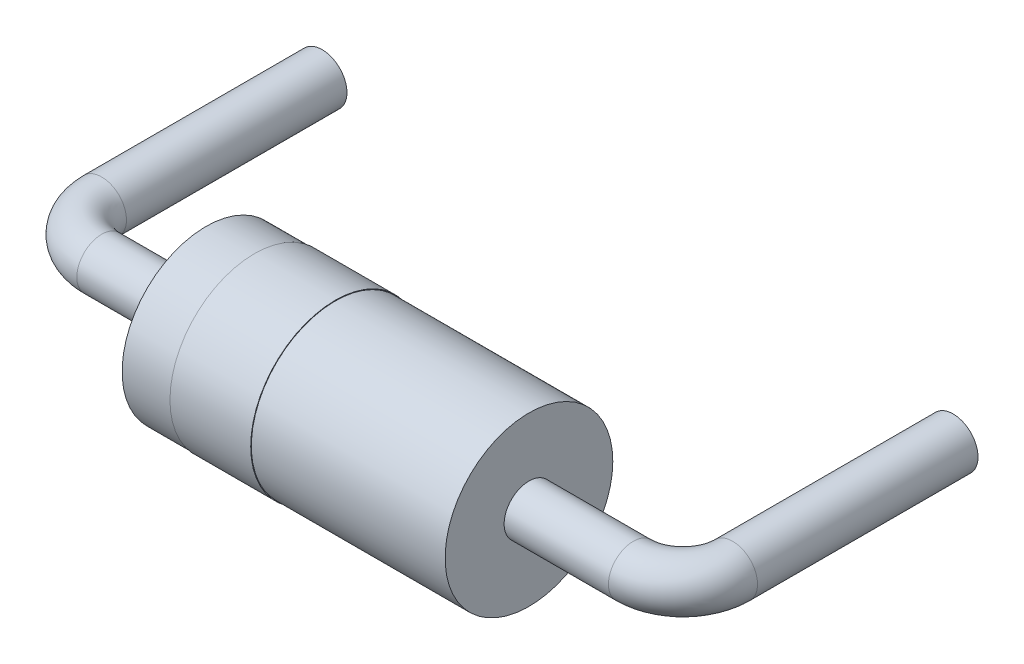
ISO-10303-21;
HEADER;
FILE_DESCRIPTION(('STEP AP214'),'2;1');
FILE_NAME('part.step','',(''),(''),'','','');
FILE_SCHEMA(('AUTOMOTIVE_DESIGN { 1 0 10303 214 1 1 1 1 }'));
ENDSEC;
DATA;
#1=APPLICATION_CONTEXT('core data for automotive mechanical design processes');
#2=APPLICATION_PROTOCOL_DEFINITION('international standard','automotive_design',2000,#1);
#3=PRODUCT_CONTEXT('',#1,'mechanical');
#4=PRODUCT('Part','Part','',(#3));
#5=PRODUCT_RELATED_PRODUCT_CATEGORY('part','',(#4));
#6=PRODUCT_DEFINITION_FORMATION('','',#4);
#7=PRODUCT_DEFINITION_CONTEXT('part definition',#1,'design');
#8=PRODUCT_DEFINITION('design','',#6,#7);
#9=PRODUCT_DEFINITION_SHAPE('','',#8);
#10=(LENGTH_UNIT() NAMED_UNIT(*) SI_UNIT(.MILLI.,.METRE.));
#11=(NAMED_UNIT(*) PLANE_ANGLE_UNIT() SI_UNIT($,.RADIAN.));
#12=(NAMED_UNIT(*) SI_UNIT($,.STERADIAN.) SOLID_ANGLE_UNIT());
#13=UNCERTAINTY_MEASURE_WITH_UNIT(LENGTH_MEASURE(1.E-05),#10,'distance_accuracy_value','');
#14=(GEOMETRIC_REPRESENTATION_CONTEXT(3) GLOBAL_UNCERTAINTY_ASSIGNED_CONTEXT((#13)) GLOBAL_UNIT_ASSIGNED_CONTEXT((#10,
#11,#12)) REPRESENTATION_CONTEXT('',''));
#15=CARTESIAN_POINT('',(0.,0.,0.));
#16=DIRECTION('',(0.,0.,1.));
#17=DIRECTION('',(1.,0.,0.));
#18=AXIS2_PLACEMENT_3D('',#15,#16,#17);
#19=CARTESIAN_POINT('',(0.4,0.,-2.5));
#20=DIRECTION('',(0.,0.,-1.));
#21=DIRECTION('',(-1.,0.,0.));
#22=AXIS2_PLACEMENT_3D('',#19,#20,#21);
#23=PLANE('',#22);
#24=CARTESIAN_POINT('',(0.,0.,-2.5));
#25=DIRECTION('',(0.,0.,1.));
#26=DIRECTION('',(0.,-1.,0.));
#27=AXIS2_PLACEMENT_3D('',#24,#25,#26);
#28=CIRCLE('',#27,0.4);
#29=CARTESIAN_POINT('',(0.,-0.4,-2.5));
#30=VERTEX_POINT('',#29);
#31=EDGE_CURVE('E18',#30,#30,#28,.T.);
#32=ORIENTED_EDGE('',*,*,#31,.F.);
#33=EDGE_LOOP('',(#32));
#34=FACE_BOUND('',#33,.T.);
#35=ADVANCED_FACE('F15',(#34),#23,.T.);
#36=CARTESIAN_POINT('',(0.,0.,1.05));
#37=DIRECTION('',(0.,0.,1.));
#38=DIRECTION('',(0.,-1.,0.));
#39=AXIS2_PLACEMENT_3D('',#36,#37,#38);
#40=CYLINDRICAL_SURFACE('',#39,0.4);
#41=CARTESIAN_POINT('',(0.,0.,1.05));
#42=DIRECTION('',(0.,0.,1.));
#43=DIRECTION('',(-1.,0.,0.));
#44=AXIS2_PLACEMENT_3D('',#41,#42,#43);
#45=CIRCLE('',#44,0.4);
#46=CARTESIAN_POINT('',(-0.4,0.,1.05));
#47=VERTEX_POINT('',#46);
#48=EDGE_CURVE('E30',#47,#47,#45,.T.);
#49=ORIENTED_EDGE('',*,*,#48,.F.);
#50=EDGE_LOOP('',(#49));
#51=FACE_BOUND('',#50,.T.);
#52=ORIENTED_EDGE('',*,*,#31,.T.);
#53=EDGE_LOOP('',(#52));
#54=FACE_BOUND('',#53,.T.);
#55=ADVANCED_FACE('F69',(#51,#54),#40,.T.);
#56=CARTESIAN_POINT('',(0.8,0.,1.05));
#57=DIRECTION('',(0.,1.,0.));
#58=DIRECTION('',(1.,0.,0.));
#59=AXIS2_PLACEMENT_3D('',#56,#57,#58);
#60=TOROIDAL_SURFACE('',#59,0.8,0.4);
#61=CARTESIAN_POINT('',(0.8,0.,1.85));
#62=DIRECTION('',(1.,0.,0.));
#63=DIRECTION('',(0.,0.,-1.));
#64=AXIS2_PLACEMENT_3D('',#61,#62,#63);
#65=CIRCLE('',#64,0.4);
#66=CARTESIAN_POINT('',(0.8,0.,1.45));
#67=VERTEX_POINT('',#66);
#68=EDGE_CURVE('E53',#67,#67,#65,.T.);
#69=ORIENTED_EDGE('',*,*,#68,.F.);
#70=EDGE_LOOP('',(#69));
#71=FACE_BOUND('',#70,.T.);
#72=ORIENTED_EDGE('',*,*,#48,.T.);
#73=EDGE_LOOP('',(#72));
#74=FACE_BOUND('',#73,.T.);
#75=ADVANCED_FACE('F65',(#71,#74),#60,.T.);
#76=CARTESIAN_POINT('',(0.8,0.,1.85));
#77=DIRECTION('',(1.,0.,0.));
#78=DIRECTION('',(0.,0.,-1.));
#79=AXIS2_PLACEMENT_3D('',#76,#77,#78);
#80=CYLINDRICAL_SURFACE('',#79,0.4);
#81=CARTESIAN_POINT('',(2.48,0.,1.85));
#82=DIRECTION('',(1.,0.,0.));
#83=DIRECTION('',(0.,0.,-1.));
#84=AXIS2_PLACEMENT_3D('',#81,#82,#83);
#85=CIRCLE('',#84,0.4);
#86=CARTESIAN_POINT('',(2.48,0.,1.45));
#87=VERTEX_POINT('',#86);
#88=EDGE_CURVE('E51',#87,#87,#85,.F.);
#89=ORIENTED_EDGE('',*,*,#88,.T.);
#90=EDGE_LOOP('',(#89));
#91=FACE_BOUND('',#90,.T.);
#92=ORIENTED_EDGE('',*,*,#68,.T.);
#93=EDGE_LOOP('',(#92));
#94=FACE_BOUND('',#93,.T.);
#95=ADVANCED_FACE('F68',(#91,#94),#80,.T.);
#96=CARTESIAN_POINT('',(2.48,0.,1.85));
#97=DIRECTION('',(1.,0.,0.));
#98=DIRECTION('',(0.,0.,-1.));
#99=AXIS2_PLACEMENT_3D('',#96,#97,#98);
#100=PLANE('',#99);
#101=ORIENTED_EDGE('',*,*,#88,.F.);
#102=EDGE_LOOP('',(#101));
#103=FACE_BOUND('',#102,.T.);
#104=CARTESIAN_POINT('',(2.48,0.,1.85));
#105=DIRECTION('',(1.,0.,0.));
#106=DIRECTION('',(0.,0.,-1.));
#107=AXIS2_PLACEMENT_3D('',#104,#105,#106);
#108=CIRCLE('',#107,1.35);
#109=CARTESIAN_POINT('',(2.48,0.,0.5));
#110=VERTEX_POINT('',#109);
#111=EDGE_CURVE('E49',#110,#110,#108,.T.);
#112=ORIENTED_EDGE('',*,*,#111,.F.);
#113=EDGE_LOOP('',(#112));
#114=FACE_BOUND('',#113,.T.);
#115=ADVANCED_FACE('F130',(#103,#114),#100,.F.);
#116=CARTESIAN_POINT('',(9.76,0.,-2.5));
#117=DIRECTION('',(0.,0.,1.));
#118=DIRECTION('',(1.,0.,0.));
#119=AXIS2_PLACEMENT_3D('',#116,#117,#118);
#120=PLANE('',#119);
#121=CARTESIAN_POINT('',(10.16,0.,-2.5));
#122=DIRECTION('',(0.,0.,-1.));
#123=DIRECTION('',(0.,1.,0.));
#124=AXIS2_PLACEMENT_3D('',#121,#122,#123);
#125=CIRCLE('',#124,0.4);
#126=CARTESIAN_POINT('',(10.16,0.4,-2.5));
#127=VERTEX_POINT('',#126);
#128=EDGE_CURVE('E46',#127,#127,#125,.F.);
#129=ORIENTED_EDGE('',*,*,#128,.F.);
#130=EDGE_LOOP('',(#129));
#131=FACE_BOUND('',#130,.T.);
#132=ADVANCED_FACE('F127',(#131),#120,.F.);
#133=CARTESIAN_POINT('',(2.48,0.,1.85));
#134=DIRECTION('',(1.,0.,0.));
#135=DIRECTION('',(0.,0.,-1.));
#136=AXIS2_PLACEMENT_3D('',#133,#134,#135);
#137=CYLINDRICAL_SURFACE('',#136,1.35);
#138=ORIENTED_EDGE('',*,*,#111,.T.);
#139=EDGE_LOOP('',(#138));
#140=FACE_BOUND('',#139,.T.);
#141=CARTESIAN_POINT('',(3.26,0.,1.85));
#142=DIRECTION('',(1.,0.,0.));
#143=DIRECTION('',(0.,0.,-1.));
#144=AXIS2_PLACEMENT_3D('',#141,#142,#143);
#145=CIRCLE('',#144,1.35);
#146=CARTESIAN_POINT('',(3.26,0.,0.5));
#147=VERTEX_POINT('',#146);
#148=EDGE_CURVE('E43',#147,#147,#145,.F.);
#149=ORIENTED_EDGE('',*,*,#148,.T.);
#150=EDGE_LOOP('',(#149));
#151=FACE_BOUND('',#150,.T.);
#152=ADVANCED_FACE('F123',(#140,#151),#137,.T.);
#153=CARTESIAN_POINT('',(10.16,0.,1.05));
#154=DIRECTION('',(0.,0.,-1.));
#155=DIRECTION('',(0.,1.,0.));
#156=AXIS2_PLACEMENT_3D('',#153,#154,#155);
#157=CYLINDRICAL_SURFACE('',#156,0.4);
#158=ORIENTED_EDGE('',*,*,#128,.T.);
#159=EDGE_LOOP('',(#158));
#160=FACE_BOUND('',#159,.T.);
#161=CARTESIAN_POINT('',(10.16,0.,1.05));
#162=DIRECTION('',(0.,0.,-1.));
#163=DIRECTION('',(1.,0.,0.));
#164=AXIS2_PLACEMENT_3D('',#161,#162,#163);
#165=CIRCLE('',#164,0.4);
#166=CARTESIAN_POINT('',(10.56,0.,1.05));
#167=VERTEX_POINT('',#166);
#168=EDGE_CURVE('E42',#167,#167,#165,.F.);
#169=ORIENTED_EDGE('',*,*,#168,.F.);
#170=EDGE_LOOP('',(#169));
#171=FACE_BOUND('',#170,.T.);
#172=ADVANCED_FACE('F119',(#160,#171),#157,.T.);
#173=CARTESIAN_POINT('',(3.26,0.,1.85));
#174=DIRECTION('',(1.,0.,0.));
#175=DIRECTION('',(0.,0.,-1.));
#176=AXIS2_PLACEMENT_3D('',#173,#174,#175);
#177=PLANE('',#176);
#178=ORIENTED_EDGE('',*,*,#148,.F.);
#179=EDGE_LOOP('',(#178));
#180=FACE_BOUND('',#179,.T.);
#181=CARTESIAN_POINT('',(3.26,0.,1.85));
#182=DIRECTION('',(1.,0.,0.));
#183=DIRECTION('',(0.,0.,-1.));
#184=AXIS2_PLACEMENT_3D('',#181,#182,#183);
#185=CIRCLE('',#184,1.36);
#186=CARTESIAN_POINT('',(3.26,0.,0.49));
#187=VERTEX_POINT('',#186);
#188=EDGE_CURVE('E39',#187,#187,#185,.T.);
#189=ORIENTED_EDGE('',*,*,#188,.F.);
#190=EDGE_LOOP('',(#189));
#191=FACE_BOUND('',#190,.T.);
#192=ADVANCED_FACE('F107',(#180,#191),#177,.F.);
#193=CARTESIAN_POINT('',(9.36,0.,1.05));
#194=DIRECTION('',(0.,1.,0.));
#195=DIRECTION('',(1.,0.,0.));
#196=AXIS2_PLACEMENT_3D('',#193,#194,#195);
#197=TOROIDAL_SURFACE('',#196,0.8,0.4);
#198=ORIENTED_EDGE('',*,*,#168,.T.);
#199=EDGE_LOOP('',(#198));
#200=FACE_BOUND('',#199,.T.);
#201=CARTESIAN_POINT('',(9.36,0.,1.85));
#202=DIRECTION('',(1.,0.,0.));
#203=DIRECTION('',(0.,0.,-1.));
#204=AXIS2_PLACEMENT_3D('',#201,#202,#203);
#205=CIRCLE('',#204,0.4);
#206=CARTESIAN_POINT('',(9.36,0.,1.45));
#207=VERTEX_POINT('',#206);
#208=EDGE_CURVE('E38',#207,#207,#205,.F.);
#209=ORIENTED_EDGE('',*,*,#208,.F.);
#210=EDGE_LOOP('',(#209));
#211=FACE_BOUND('',#210,.T.);
#212=ADVANCED_FACE('F103',(#200,#211),#197,.T.);
#213=CARTESIAN_POINT('',(3.26,0.,1.85));
#214=DIRECTION('',(1.,0.,0.));
#215=DIRECTION('',(0.,0.,-1.));
#216=AXIS2_PLACEMENT_3D('',#213,#214,#215);
#217=CYLINDRICAL_SURFACE('',#216,1.36);
#218=CARTESIAN_POINT('',(4.56,0.,1.85));
#219=DIRECTION('',(1.,0.,0.));
#220=DIRECTION('',(0.,0.,-1.));
#221=AXIS2_PLACEMENT_3D('',#218,#219,#220);
#222=CIRCLE('',#221,1.36);
#223=CARTESIAN_POINT('',(4.56,0.,0.49));
#224=VERTEX_POINT('',#223);
#225=EDGE_CURVE('E35',#224,#224,#222,.T.);
#226=ORIENTED_EDGE('',*,*,#225,.F.);
#227=EDGE_LOOP('',(#226));
#228=FACE_BOUND('',#227,.T.);
#229=ORIENTED_EDGE('',*,*,#188,.T.);
#230=EDGE_LOOP('',(#229));
#231=FACE_BOUND('',#230,.T.);
#232=ADVANCED_FACE('F99',(#228,#231),#217,.T.);
#233=CARTESIAN_POINT('',(0.8,0.,1.85));
#234=DIRECTION('',(1.,0.,0.));
#235=DIRECTION('',(0.,0.,-1.));
#236=AXIS2_PLACEMENT_3D('',#233,#234,#235);
#237=CYLINDRICAL_SURFACE('',#236,0.4);
#238=ORIENTED_EDGE('',*,*,#208,.T.);
#239=EDGE_LOOP('',(#238));
#240=FACE_BOUND('',#239,.T.);
#241=CARTESIAN_POINT('',(7.68,0.,1.85));
#242=DIRECTION('',(1.,0.,0.));
#243=DIRECTION('',(0.,0.,-1.));
#244=AXIS2_PLACEMENT_3D('',#241,#242,#243);
#245=CIRCLE('',#244,0.4);
#246=CARTESIAN_POINT('',(7.68,0.,1.45));
#247=VERTEX_POINT('',#246);
#248=EDGE_CURVE('E27',#247,#247,#245,.F.);
#249=ORIENTED_EDGE('',*,*,#248,.F.);
#250=EDGE_LOOP('',(#249));
#251=FACE_BOUND('',#250,.T.);
#252=ADVANCED_FACE('F95',(#240,#251),#237,.T.);
#253=CARTESIAN_POINT('',(4.56,0.,1.85));
#254=DIRECTION('',(1.,0.,0.));
#255=DIRECTION('',(0.,0.,-1.));
#256=AXIS2_PLACEMENT_3D('',#253,#254,#255);
#257=PLANE('',#256);
#258=CARTESIAN_POINT('',(4.56,0.,1.85));
#259=DIRECTION('',(1.,0.,0.));
#260=DIRECTION('',(0.,0.,-1.));
#261=AXIS2_PLACEMENT_3D('',#258,#259,#260);
#262=CIRCLE('',#261,1.35);
#263=CARTESIAN_POINT('',(4.56,0.,0.5));
#264=VERTEX_POINT('',#263);
#265=EDGE_CURVE('E22',#264,#264,#262,.T.);
#266=ORIENTED_EDGE('',*,*,#265,.F.);
#267=EDGE_LOOP('',(#266));
#268=FACE_BOUND('',#267,.T.);
#269=ORIENTED_EDGE('',*,*,#225,.T.);
#270=EDGE_LOOP('',(#269));
#271=FACE_BOUND('',#270,.T.);
#272=ADVANCED_FACE('F88',(#268,#271),#257,.T.);
#273=CARTESIAN_POINT('',(7.68,0.,1.85));
#274=DIRECTION('',(1.,0.,0.));
#275=DIRECTION('',(0.,0.,-1.));
#276=AXIS2_PLACEMENT_3D('',#273,#274,#275);
#277=PLANE('',#276);
#278=ORIENTED_EDGE('',*,*,#248,.T.);
#279=EDGE_LOOP('',(#278));
#280=FACE_BOUND('',#279,.T.);
#281=CARTESIAN_POINT('',(7.68,0.,1.85));
#282=DIRECTION('',(1.,0.,0.));
#283=DIRECTION('',(0.,0.,-1.));
#284=AXIS2_PLACEMENT_3D('',#281,#282,#283);
#285=CIRCLE('',#284,1.35);
#286=CARTESIAN_POINT('',(7.68,0.,0.5));
#287=VERTEX_POINT('',#286);
#288=EDGE_CURVE('E10',#287,#287,#285,.F.);
#289=ORIENTED_EDGE('',*,*,#288,.F.);
#290=EDGE_LOOP('',(#289));
#291=FACE_BOUND('',#290,.T.);
#292=ADVANCED_FACE('F83',(#280,#291),#277,.T.);
#293=CARTESIAN_POINT('',(2.48,0.,1.85));
#294=DIRECTION('',(1.,0.,0.));
#295=DIRECTION('',(0.,0.,-1.));
#296=AXIS2_PLACEMENT_3D('',#293,#294,#295);
#297=CYLINDRICAL_SURFACE('',#296,1.35);
#298=ORIENTED_EDGE('',*,*,#288,.T.);
#299=EDGE_LOOP('',(#298));
#300=FACE_BOUND('',#299,.T.);
#301=ORIENTED_EDGE('',*,*,#265,.T.);
#302=EDGE_LOOP('',(#301));
#303=FACE_BOUND('',#302,.T.);
#304=ADVANCED_FACE('F81',(#300,#303),#297,.T.);
#305=CLOSED_SHELL('',(#35,#55,#75,#95,#115,#132,#152,#172,#192,#212,#232,#252,#272,#292,#304));
#306=MANIFOLD_SOLID_BREP('B1',#305);
#307=ADVANCED_BREP_SHAPE_REPRESENTATION('',(#18,#306),#14);
#308=SHAPE_DEFINITION_REPRESENTATION(#9,#307);
ENDSEC;
END-ISO-10303-21;
